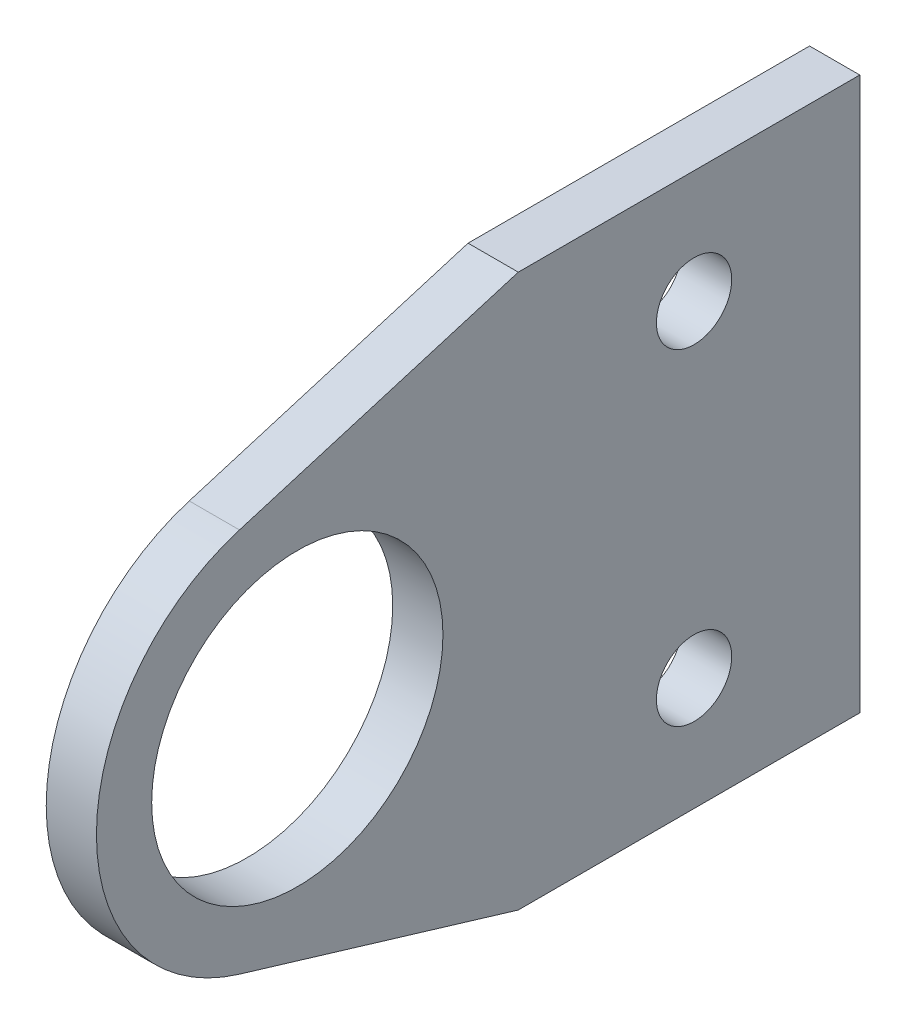
ISO-10303-21;
HEADER;
FILE_DESCRIPTION(('STEP AP214'),'2;1');
FILE_NAME('part.step','',(''),(''),'','','');
FILE_SCHEMA(('AUTOMOTIVE_DESIGN { 1 0 10303 214 1 1 1 1 }'));
ENDSEC;
DATA;
#1=APPLICATION_CONTEXT('core data for automotive mechanical design processes');
#2=APPLICATION_PROTOCOL_DEFINITION('international standard','automotive_design',2000,#1);
#3=PRODUCT_CONTEXT('',#1,'mechanical');
#4=PRODUCT('Part','Part','',(#3));
#5=PRODUCT_RELATED_PRODUCT_CATEGORY('part','',(#4));
#6=PRODUCT_DEFINITION_FORMATION('','',#4);
#7=PRODUCT_DEFINITION_CONTEXT('part definition',#1,'design');
#8=PRODUCT_DEFINITION('design','',#6,#7);
#9=PRODUCT_DEFINITION_SHAPE('','',#8);
#10=(LENGTH_UNIT() NAMED_UNIT(*) SI_UNIT(.MILLI.,.METRE.));
#11=(NAMED_UNIT(*) PLANE_ANGLE_UNIT() SI_UNIT($,.RADIAN.));
#12=(NAMED_UNIT(*) SI_UNIT($,.STERADIAN.) SOLID_ANGLE_UNIT());
#13=UNCERTAINTY_MEASURE_WITH_UNIT(LENGTH_MEASURE(1.E-05),#10,'distance_accuracy_value','');
#14=(GEOMETRIC_REPRESENTATION_CONTEXT(3) GLOBAL_UNCERTAINTY_ASSIGNED_CONTEXT((#13)) GLOBAL_UNIT_ASSIGNED_CONTEXT((#10,
#11,#12)) REPRESENTATION_CONTEXT('',''));
#15=CARTESIAN_POINT('',(0.,0.,0.));
#16=DIRECTION('',(0.,0.,1.));
#17=DIRECTION('',(1.,0.,0.));
#18=AXIS2_PLACEMENT_3D('',#15,#16,#17);
#19=CARTESIAN_POINT('',(-95.,38.3056788159798,11.5184621563384));
#20=DIRECTION('',(0.,0.957641970399494,0.287961553908459));
#21=DIRECTION('',(0.,0.287961553908459,-0.957641970399494));
#22=AXIS2_PLACEMENT_3D('',#19,#20,#21);
#23=PLANE('',#22);
#24=DIRECTION('',(-1.,0.,0.));
#25=VECTOR('',#24,1.);
#26=CARTESIAN_POINT('',(-95.,38.3056788159798,11.5184621563384));
#27=LINE('',#26,#25);
#28=CARTESIAN_POINT('',(-85.,38.3056788159798,11.5184621563384));
#29=VERTEX_POINT('',#28);
#30=CARTESIAN_POINT('',(-95.,38.3056788159798,11.5184621563384));
#31=VERTEX_POINT('',#30);
#32=EDGE_CURVE('E11',#29,#31,#27,.T.);
#33=ORIENTED_EDGE('',*,*,#32,.F.);
#34=DIRECTION('',(0.,0.287961553908459,-0.957641970399494));
#35=VECTOR('',#34,1.);
#36=CARTESIAN_POINT('',(-85.,38.3056788159798,11.5184621563384));
#37=LINE('',#36,#35);
#38=CARTESIAN_POINT('',(-85.,55.,-44.));
#39=VERTEX_POINT('',#38);
#40=EDGE_CURVE('E99',#29,#39,#37,.T.);
#41=ORIENTED_EDGE('',*,*,#40,.T.);
#42=DIRECTION('',(-1.,0.,0.));
#43=VECTOR('',#42,1.);
#44=CARTESIAN_POINT('',(-95.,55.,-44.));
#45=LINE('',#44,#43);
#46=CARTESIAN_POINT('',(-95.,55.,-44.));
#47=VERTEX_POINT('',#46);
#48=EDGE_CURVE('E46',#39,#47,#45,.T.);
#49=ORIENTED_EDGE('',*,*,#48,.T.);
#50=DIRECTION('',(0.,0.287961553908459,-0.957641970399494));
#51=VECTOR('',#50,1.);
#52=CARTESIAN_POINT('',(-95.,38.3056788159798,11.5184621563384));
#53=LINE('',#52,#51);
#54=EDGE_CURVE('E131',#31,#47,#53,.T.);
#55=ORIENTED_EDGE('',*,*,#54,.F.);
#56=EDGE_LOOP('',(#33,#41,#49,#55));
#57=FACE_BOUND('',#56,.T.);
#58=ADVANCED_FACE('F36',(#57),#23,.T.);
#59=CARTESIAN_POINT('',(-95.,55.,-112.));
#60=DIRECTION('',(0.,-1.,0.));
#61=DIRECTION('',(0.,0.,1.));
#62=AXIS2_PLACEMENT_3D('',#59,#60,#61);
#63=PLANE('',#62);
#64=ORIENTED_EDGE('',*,*,#48,.F.);
#65=DIRECTION('',(0.,0.,-1.));
#66=VECTOR('',#65,1.);
#67=CARTESIAN_POINT('',(-85.,55.,0.));
#68=LINE('',#67,#66);
#69=CARTESIAN_POINT('',(-85.,55.,-112.));
#70=VERTEX_POINT('',#69);
#71=EDGE_CURVE('E115',#70,#39,#68,.F.);
#72=ORIENTED_EDGE('',*,*,#71,.F.);
#73=DIRECTION('',(-1.,0.,0.));
#74=VECTOR('',#73,1.);
#75=CARTESIAN_POINT('',(-95.,55.,-112.));
#76=LINE('',#75,#74);
#77=CARTESIAN_POINT('',(-95.,55.,-112.));
#78=VERTEX_POINT('',#77);
#79=EDGE_CURVE('E124',#70,#78,#76,.T.);
#80=ORIENTED_EDGE('',*,*,#79,.T.);
#81=DIRECTION('',(0.,0.,1.));
#82=VECTOR('',#81,1.);
#83=CARTESIAN_POINT('',(-95.,55.,-112.));
#84=LINE('',#83,#82);
#85=EDGE_CURVE('E141',#78,#47,#84,.T.);
#86=ORIENTED_EDGE('',*,*,#85,.T.);
#87=EDGE_LOOP('',(#64,#72,#80,#86));
#88=FACE_BOUND('',#87,.T.);
#89=ADVANCED_FACE('F144',(#88),#63,.F.);
#90=CARTESIAN_POINT('',(-95.,55.,-112.));
#91=DIRECTION('',(0.,0.,-1.));
#92=DIRECTION('',(0.,-1.,0.));
#93=AXIS2_PLACEMENT_3D('',#90,#91,#92);
#94=PLANE('',#93);
#95=ORIENTED_EDGE('',*,*,#79,.F.);
#96=DIRECTION('',(0.,-1.,0.));
#97=VECTOR('',#96,1.);
#98=CARTESIAN_POINT('',(-85.,0.,-112.));
#99=LINE('',#98,#97);
#100=CARTESIAN_POINT('',(-85.,-55.,-112.));
#101=VERTEX_POINT('',#100);
#102=EDGE_CURVE('E112',#70,#101,#99,.T.);
#103=ORIENTED_EDGE('',*,*,#102,.T.);
#104=DIRECTION('',(-1.,0.,0.));
#105=VECTOR('',#104,1.);
#106=CARTESIAN_POINT('',(-95.,-55.,-112.));
#107=LINE('',#106,#105);
#108=CARTESIAN_POINT('',(-95.,-55.,-112.));
#109=VERTEX_POINT('',#108);
#110=EDGE_CURVE('E122',#101,#109,#107,.T.);
#111=ORIENTED_EDGE('',*,*,#110,.T.);
#112=DIRECTION('',(0.,-1.,0.));
#113=VECTOR('',#112,1.);
#114=CARTESIAN_POINT('',(-95.,55.,-112.));
#115=LINE('',#114,#113);
#116=EDGE_CURVE('E145',#78,#109,#115,.T.);
#117=ORIENTED_EDGE('',*,*,#116,.F.);
#118=EDGE_LOOP('',(#95,#103,#111,#117));
#119=FACE_BOUND('',#118,.T.);
#120=ADVANCED_FACE('F185',(#119),#94,.T.);
#121=CARTESIAN_POINT('',(-95.,-55.,-112.));
#122=DIRECTION('',(0.,-1.,0.));
#123=DIRECTION('',(0.,0.,1.));
#124=AXIS2_PLACEMENT_3D('',#121,#122,#123);
#125=PLANE('',#124);
#126=ORIENTED_EDGE('',*,*,#110,.F.);
#127=DIRECTION('',(0.,0.,-1.));
#128=VECTOR('',#127,1.);
#129=CARTESIAN_POINT('',(-85.,-55.,0.));
#130=LINE('',#129,#128);
#131=CARTESIAN_POINT('',(-85.,-55.,-44.));
#132=VERTEX_POINT('',#131);
#133=EDGE_CURVE('E109',#101,#132,#130,.F.);
#134=ORIENTED_EDGE('',*,*,#133,.T.);
#135=DIRECTION('',(-1.,0.,0.));
#136=VECTOR('',#135,1.);
#137=CARTESIAN_POINT('',(-95.,-55.,-44.));
#138=LINE('',#137,#136);
#139=CARTESIAN_POINT('',(-95.,-55.,-44.));
#140=VERTEX_POINT('',#139);
#141=EDGE_CURVE('E54',#132,#140,#138,.T.);
#142=ORIENTED_EDGE('',*,*,#141,.T.);
#143=DIRECTION('',(0.,0.,1.));
#144=VECTOR('',#143,1.);
#145=CARTESIAN_POINT('',(-95.,-55.,-112.));
#146=LINE('',#145,#144);
#147=EDGE_CURVE('E147',#109,#140,#146,.T.);
#148=ORIENTED_EDGE('',*,*,#147,.F.);
#149=EDGE_LOOP('',(#126,#134,#142,#148));
#150=FACE_BOUND('',#149,.T.);
#151=ADVANCED_FACE('F190',(#150),#125,.T.);
#152=CARTESIAN_POINT('',(-95.,-38.3056788159798,11.5184621563384));
#153=DIRECTION('',(0.,-0.957641970399494,0.287961553908459));
#154=DIRECTION('',(0.,0.287961553908459,0.957641970399494));
#155=AXIS2_PLACEMENT_3D('',#152,#153,#154);
#156=PLANE('',#155);
#157=ORIENTED_EDGE('',*,*,#141,.F.);
#158=DIRECTION('',(0.,0.287961553908459,0.957641970399494));
#159=VECTOR('',#158,1.);
#160=CARTESIAN_POINT('',(-85.,-38.3056788159798,11.5184621563384));
#161=LINE('',#160,#159);
#162=CARTESIAN_POINT('',(-85.,-38.3056788159798,11.5184621563384));
#163=VERTEX_POINT('',#162);
#164=EDGE_CURVE('E97',#132,#163,#161,.T.);
#165=ORIENTED_EDGE('',*,*,#164,.T.);
#166=DIRECTION('',(-1.,0.,0.));
#167=VECTOR('',#166,1.);
#168=CARTESIAN_POINT('',(-95.,-38.3056788159798,11.5184621563384));
#169=LINE('',#168,#167);
#170=CARTESIAN_POINT('',(-95.,-38.3056788159798,11.5184621563384));
#171=VERTEX_POINT('',#170);
#172=EDGE_CURVE('E40',#163,#171,#169,.T.);
#173=ORIENTED_EDGE('',*,*,#172,.T.);
#174=DIRECTION('',(0.,0.287961553908459,0.957641970399494));
#175=VECTOR('',#174,1.);
#176=CARTESIAN_POINT('',(-95.,-38.3056788159798,11.5184621563384));
#177=LINE('',#176,#175);
#178=EDGE_CURVE('E311',#140,#171,#177,.T.);
#179=ORIENTED_EDGE('',*,*,#178,.F.);
#180=EDGE_LOOP('',(#157,#165,#173,#179));
#181=FACE_BOUND('',#180,.T.);
#182=ADVANCED_FACE('F101',(#181),#156,.T.);
#183=CARTESIAN_POINT('',(-95.,32.5,-79.));
#184=DIRECTION('',(-1.,0.,0.));
#185=DIRECTION('',(0.,0.,1.));
#186=AXIS2_PLACEMENT_3D('',#183,#184,#185);
#187=CYLINDRICAL_SURFACE('',#186,7.5);
#188=CARTESIAN_POINT('',(-95.,32.5,-79.));
#189=DIRECTION('',(1.,0.,0.));
#190=DIRECTION('',(0.,0.,-1.));
#191=AXIS2_PLACEMENT_3D('',#188,#189,#190);
#192=CIRCLE('',#191,7.5);
#193=CARTESIAN_POINT('',(-95.,32.5,-86.5));
#194=VERTEX_POINT('',#193);
#195=EDGE_CURVE('E120',#194,#194,#192,.T.);
#196=ORIENTED_EDGE('',*,*,#195,.F.);
#197=EDGE_LOOP('',(#196));
#198=FACE_BOUND('',#197,.T.);
#199=CARTESIAN_POINT('',(-85.,32.5,-79.));
#200=DIRECTION('',(1.,0.,0.));
#201=DIRECTION('',(0.,0.,-1.));
#202=AXIS2_PLACEMENT_3D('',#199,#200,#201);
#203=CIRCLE('',#202,7.5);
#204=CARTESIAN_POINT('',(-85.,32.5,-86.5));
#205=VERTEX_POINT('',#204);
#206=EDGE_CURVE('E105',#205,#205,#203,.T.);
#207=ORIENTED_EDGE('',*,*,#206,.T.);
#208=EDGE_LOOP('',(#207));
#209=FACE_BOUND('',#208,.T.);
#210=ADVANCED_FACE('F157',(#198,#209),#187,.F.);
#211=CARTESIAN_POINT('',(-95.,-32.5,-79.));
#212=DIRECTION('',(-1.,0.,0.));
#213=DIRECTION('',(0.,0.,1.));
#214=AXIS2_PLACEMENT_3D('',#211,#212,#213);
#215=CYLINDRICAL_SURFACE('',#214,7.5);
#216=CARTESIAN_POINT('',(-95.,-32.5,-79.));
#217=DIRECTION('',(1.,0.,0.));
#218=DIRECTION('',(0.,0.,-1.));
#219=AXIS2_PLACEMENT_3D('',#216,#217,#218);
#220=CIRCLE('',#219,7.5);
#221=CARTESIAN_POINT('',(-95.,-32.5,-86.5));
#222=VERTEX_POINT('',#221);
#223=EDGE_CURVE('E310',#222,#222,#220,.T.);
#224=ORIENTED_EDGE('',*,*,#223,.F.);
#225=EDGE_LOOP('',(#224));
#226=FACE_BOUND('',#225,.T.);
#227=CARTESIAN_POINT('',(-85.,-32.5,-79.));
#228=DIRECTION('',(1.,0.,0.));
#229=DIRECTION('',(0.,0.,-1.));
#230=AXIS2_PLACEMENT_3D('',#227,#228,#229);
#231=CIRCLE('',#230,7.5);
#232=CARTESIAN_POINT('',(-85.,-32.5,-86.5));
#233=VERTEX_POINT('',#232);
#234=EDGE_CURVE('E102',#233,#233,#231,.T.);
#235=ORIENTED_EDGE('',*,*,#234,.T.);
#236=EDGE_LOOP('',(#235));
#237=FACE_BOUND('',#236,.T.);
#238=ADVANCED_FACE('F164',(#226,#237),#215,.F.);
#239=CARTESIAN_POINT('',(-95.,0.,0.));
#240=DIRECTION('',(-1.,0.,0.));
#241=DIRECTION('',(0.,0.,1.));
#242=AXIS2_PLACEMENT_3D('',#239,#240,#241);
#243=CYLINDRICAL_SURFACE('',#242,40.);
#244=CARTESIAN_POINT('',(-85.,0.,0.));
#245=DIRECTION('',(1.,0.,0.));
#246=DIRECTION('',(0.,0.,-1.));
#247=AXIS2_PLACEMENT_3D('',#244,#245,#246);
#248=CIRCLE('',#247,40.);
#249=EDGE_CURVE('E85',#29,#163,#248,.T.);
#250=ORIENTED_EDGE('',*,*,#249,.F.);
#251=ORIENTED_EDGE('',*,*,#32,.T.);
#252=CARTESIAN_POINT('',(-95.,0.,0.));
#253=DIRECTION('',(1.,0.,0.));
#254=DIRECTION('',(0.,0.,-1.));
#255=AXIS2_PLACEMENT_3D('',#252,#253,#254);
#256=CIRCLE('',#255,40.);
#257=EDGE_CURVE('E87',#31,#171,#256,.T.);
#258=ORIENTED_EDGE('',*,*,#257,.T.);
#259=ORIENTED_EDGE('',*,*,#172,.F.);
#260=EDGE_LOOP('',(#250,#251,#258,#259));
#261=FACE_BOUND('',#260,.T.);
#262=ADVANCED_FACE('F84',(#261),#243,.T.);
#263=CARTESIAN_POINT('',(-95.,0.,0.));
#264=DIRECTION('',(-1.,0.,0.));
#265=DIRECTION('',(0.,0.,1.));
#266=AXIS2_PLACEMENT_3D('',#263,#264,#265);
#267=CYLINDRICAL_SURFACE('',#266,29.);
#268=CARTESIAN_POINT('',(-95.,0.,0.));
#269=DIRECTION('',(1.,0.,0.));
#270=DIRECTION('',(0.,0.,-1.));
#271=AXIS2_PLACEMENT_3D('',#268,#269,#270);
#272=CIRCLE('',#271,29.);
#273=CARTESIAN_POINT('',(-95.,0.,-29.));
#274=VERTEX_POINT('',#273);
#275=EDGE_CURVE('E91',#274,#274,#272,.F.);
#276=ORIENTED_EDGE('',*,*,#275,.T.);
#277=EDGE_LOOP('',(#276));
#278=FACE_BOUND('',#277,.T.);
#279=CARTESIAN_POINT('',(-85.,0.,0.));
#280=DIRECTION('',(1.,0.,0.));
#281=DIRECTION('',(0.,0.,-1.));
#282=AXIS2_PLACEMENT_3D('',#279,#280,#281);
#283=CIRCLE('',#282,29.);
#284=CARTESIAN_POINT('',(-85.,0.,-29.));
#285=VERTEX_POINT('',#284);
#286=EDGE_CURVE('E111',#285,#285,#283,.F.);
#287=ORIENTED_EDGE('',*,*,#286,.F.);
#288=EDGE_LOOP('',(#287));
#289=FACE_BOUND('',#288,.T.);
#290=ADVANCED_FACE('F38',(#278,#289),#267,.F.);
#291=CARTESIAN_POINT('',(-95.,0.,0.));
#292=DIRECTION('',(-1.,0.,0.));
#293=DIRECTION('',(0.,0.,-1.));
#294=AXIS2_PLACEMENT_3D('',#291,#292,#293);
#295=PLANE('',#294);
#296=ORIENTED_EDGE('',*,*,#195,.T.);
#297=EDGE_LOOP('',(#296));
#298=FACE_BOUND('',#297,.T.);
#299=ORIENTED_EDGE('',*,*,#223,.T.);
#300=EDGE_LOOP('',(#299));
#301=FACE_BOUND('',#300,.T.);
#302=ORIENTED_EDGE('',*,*,#178,.T.);
#303=ORIENTED_EDGE('',*,*,#257,.F.);
#304=ORIENTED_EDGE('',*,*,#54,.T.);
#305=ORIENTED_EDGE('',*,*,#85,.F.);
#306=ORIENTED_EDGE('',*,*,#116,.T.);
#307=ORIENTED_EDGE('',*,*,#147,.T.);
#308=EDGE_LOOP('',(#302,#303,#304,#305,#306,#307));
#309=FACE_BOUND('',#308,.T.);
#310=ORIENTED_EDGE('',*,*,#275,.F.);
#311=EDGE_LOOP('',(#310));
#312=FACE_BOUND('',#311,.T.);
#313=ADVANCED_FACE('F138',(#298,#301,#309,#312),#295,.T.);
#314=CARTESIAN_POINT('',(-85.,0.,0.));
#315=DIRECTION('',(-1.,0.,0.));
#316=DIRECTION('',(0.,0.,-1.));
#317=AXIS2_PLACEMENT_3D('',#314,#315,#316);
#318=PLANE('',#317);
#319=ORIENTED_EDGE('',*,*,#206,.F.);
#320=EDGE_LOOP('',(#319));
#321=FACE_BOUND('',#320,.T.);
#322=ORIENTED_EDGE('',*,*,#234,.F.);
#323=EDGE_LOOP('',(#322));
#324=FACE_BOUND('',#323,.T.);
#325=ORIENTED_EDGE('',*,*,#164,.F.);
#326=ORIENTED_EDGE('',*,*,#133,.F.);
#327=ORIENTED_EDGE('',*,*,#102,.F.);
#328=ORIENTED_EDGE('',*,*,#71,.T.);
#329=ORIENTED_EDGE('',*,*,#40,.F.);
#330=ORIENTED_EDGE('',*,*,#249,.T.);
#331=EDGE_LOOP('',(#325,#326,#327,#328,#329,#330));
#332=FACE_BOUND('',#331,.T.);
#333=ORIENTED_EDGE('',*,*,#286,.T.);
#334=EDGE_LOOP('',(#333));
#335=FACE_BOUND('',#334,.T.);
#336=ADVANCED_FACE('F94',(#321,#324,#332,#335),#318,.F.);
#337=CLOSED_SHELL('',(#58,#89,#120,#151,#182,#210,#238,#262,#290,#313,#336));
#338=MANIFOLD_SOLID_BREP('B2',#337);
#339=ADVANCED_BREP_SHAPE_REPRESENTATION('',(#18,#338),#14);
#340=SHAPE_DEFINITION_REPRESENTATION(#9,#339);
ENDSEC;
END-ISO-10303-21;
